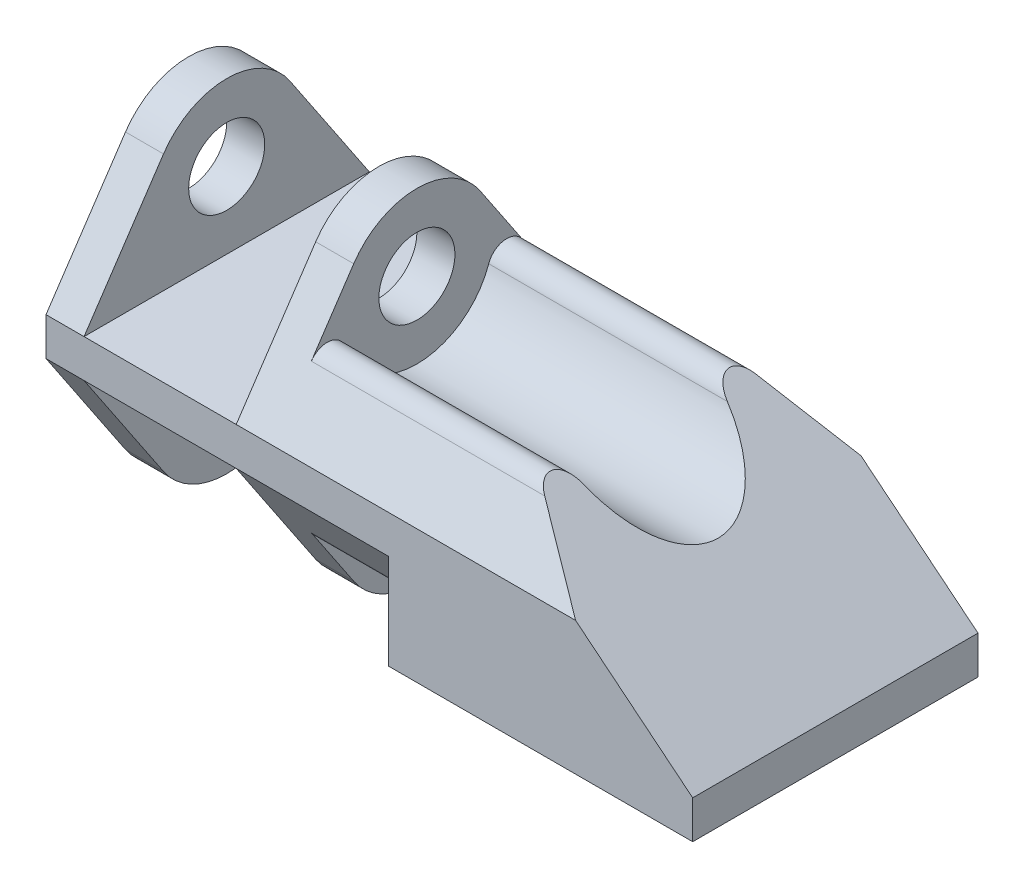
ISO-10303-21;
HEADER;
FILE_DESCRIPTION(('STEP AP214'),'2;1');
FILE_NAME('part.step','',(''),(''),'','','');
FILE_SCHEMA(('AUTOMOTIVE_DESIGN { 1 0 10303 214 1 1 1 1 }'));
ENDSEC;
DATA;
#1=APPLICATION_CONTEXT('core data for automotive mechanical design processes');
#2=APPLICATION_PROTOCOL_DEFINITION('international standard','automotive_design',2000,#1);
#3=PRODUCT_CONTEXT('',#1,'mechanical');
#4=PRODUCT('Part','Part','',(#3));
#5=PRODUCT_RELATED_PRODUCT_CATEGORY('part','',(#4));
#6=PRODUCT_DEFINITION_FORMATION('','',#4);
#7=PRODUCT_DEFINITION_CONTEXT('part definition',#1,'design');
#8=PRODUCT_DEFINITION('design','',#6,#7);
#9=PRODUCT_DEFINITION_SHAPE('','',#8);
#10=(LENGTH_UNIT() NAMED_UNIT(*) SI_UNIT(.MILLI.,.METRE.));
#11=(NAMED_UNIT(*) PLANE_ANGLE_UNIT() SI_UNIT($,.RADIAN.));
#12=(NAMED_UNIT(*) SI_UNIT($,.STERADIAN.) SOLID_ANGLE_UNIT());
#13=UNCERTAINTY_MEASURE_WITH_UNIT(LENGTH_MEASURE(1.E-05),#10,'distance_accuracy_value','');
#14=(GEOMETRIC_REPRESENTATION_CONTEXT(3) GLOBAL_UNCERTAINTY_ASSIGNED_CONTEXT((#13)) GLOBAL_UNIT_ASSIGNED_CONTEXT((#10,
#11,#12)) REPRESENTATION_CONTEXT('',''));
#15=CARTESIAN_POINT('',(0.,0.,0.));
#16=DIRECTION('',(0.,0.,1.));
#17=DIRECTION('',(1.,0.,0.));
#18=AXIS2_PLACEMENT_3D('',#15,#16,#17);
#19=CARTESIAN_POINT('',(-25.4,23.8125,11.90625));
#20=DIRECTION('',(-0.630592625094466,-0.776114000116266,0.));
#21=DIRECTION('',(0.776114000116266,-0.630592625094466,0.));
#22=AXIS2_PLACEMENT_3D('',#19,#20,#21);
#23=PLANE('',#22);
#24=DIRECTION('',(0.714789522405308,-0.580766486954313,-0.389597518331852));
#25=VECTOR('',#24,1.);
#26=CARTESIAN_POINT('',(-29.6587748598446,27.2727545736238,-1.06541255686073));
#27=LINE('',#26,#25);
#28=CARTESIAN_POINT('',(-15.4482299707213,15.7266868512111,-8.81089965397924));
#29=VERTEX_POINT('',#28);
#30=CARTESIAN_POINT('',(-9.76923076923078,11.1125,-11.90625));
#31=VERTEX_POINT('',#30);
#32=EDGE_CURVE('E168',#29,#31,#27,.T.);
#33=ORIENTED_EDGE('',*,*,#32,.F.);
#34=CARTESIAN_POINT('',(-14.359755123769,14.8423010380623,-7.49256055363323));
#35=DIRECTION('',(-0.630592625094466,-0.776114000116266,0.));
#36=DIRECTION('',(-0.776114000116266,0.630592625094466,0.));
#37=AXIS2_PLACEMENT_3D('',#34,#35,#36);
#38=ELLIPSE('',#37,2.51747314641078,1.5875);
#39=CARTESIAN_POINT('',(-15.0047271759383,15.3663408304498,-5.99404844290658));
#40=VERTEX_POINT('',#39);
#41=EDGE_CURVE('E124',#29,#40,#38,.F.);
#42=ORIENTED_EDGE('',*,*,#41,.T.);
#43=CARTESIAN_POINT('',(-17.5846153846154,17.4625,0.));
#44=DIRECTION('',(-0.630592625094466,-0.776114000116266,0.));
#45=DIRECTION('',(-0.776114000116266,0.630592625094466,0.));
#46=AXIS2_PLACEMENT_3D('',#43,#44,#45);
#47=ELLIPSE('',#46,10.0698925856431,6.35);
#48=CARTESIAN_POINT('',(-15.0047271759382,15.3663408304498,5.99404844290658));
#49=VERTEX_POINT('',#48);
#50=EDGE_CURVE('E166',#40,#49,#47,.T.);
#51=ORIENTED_EDGE('',*,*,#50,.T.);
#52=CARTESIAN_POINT('',(-14.359755123769,14.8423010380623,7.49256055363322));
#53=DIRECTION('',(-0.630592625094466,-0.776114000116266,0.));
#54=DIRECTION('',(-0.776114000116266,0.630592625094466,0.));
#55=AXIS2_PLACEMENT_3D('',#52,#53,#54);
#56=ELLIPSE('',#55,2.51747314641078,1.5875);
#57=CARTESIAN_POINT('',(-15.4482299707213,15.7266868512111,8.81089965397924));
#58=VERTEX_POINT('',#57);
#59=EDGE_CURVE('E154',#49,#58,#56,.F.);
#60=ORIENTED_EDGE('',*,*,#59,.T.);
#61=DIRECTION('',(-0.714789522405308,0.580766486954313,-0.389597518331852));
#62=VECTOR('',#61,1.);
#63=CARTESIAN_POINT('',(-23.0274645244464,21.8848149261127,4.67982207039938));
#64=LINE('',#63,#62);
#65=CARTESIAN_POINT('',(-9.76923076923077,11.1125,11.90625));
#66=VERTEX_POINT('',#65);
#67=EDGE_CURVE('E130',#66,#58,#64,.T.);
#68=ORIENTED_EDGE('',*,*,#67,.F.);
#69=DIRECTION('',(-0.776114000116265,0.630592625094466,0.));
#70=VECTOR('',#69,1.);
#71=CARTESIAN_POINT('',(-25.4,23.8125,11.90625));
#72=LINE('',#71,#70);
#73=CARTESIAN_POINT('',(0.,3.175,11.90625));
#74=VERTEX_POINT('',#73);
#75=EDGE_CURVE('E284',#74,#66,#72,.T.);
#76=ORIENTED_EDGE('',*,*,#75,.F.);
#77=DIRECTION('',(0.,0.,-1.));
#78=VECTOR('',#77,1.);
#79=CARTESIAN_POINT('',(0.,3.175,11.90625));
#80=LINE('',#79,#78);
#81=CARTESIAN_POINT('',(0.,3.175,-11.90625));
#82=VERTEX_POINT('',#81);
#83=EDGE_CURVE('E333',#74,#82,#80,.T.);
#84=ORIENTED_EDGE('',*,*,#83,.T.);
#85=DIRECTION('',(-0.776114000116265,0.630592625094466,0.));
#86=VECTOR('',#85,1.);
#87=CARTESIAN_POINT('',(-25.4,23.8125,-11.90625));
#88=LINE('',#87,#86);
#89=EDGE_CURVE('E303',#82,#31,#88,.T.);
#90=ORIENTED_EDGE('',*,*,#89,.T.);
#91=EDGE_LOOP('',(#33,#42,#51,#60,#68,#76,#84,#90));
#92=FACE_BOUND('',#91,.T.);
#93=ADVANCED_FACE('F34',(#92),#23,.F.);
#94=CARTESIAN_POINT('',(0.,0.,-11.90625));
#95=DIRECTION('',(0.,0.,-1.));
#96=DIRECTION('',(-1.,0.,0.));
#97=AXIS2_PLACEMENT_3D('',#94,#95,#96);
#98=PLANE('',#97);
#99=DIRECTION('',(-1.,0.,0.));
#100=VECTOR('',#99,1.);
#101=CARTESIAN_POINT('',(-7.99170344167758,11.1125,-11.90625));
#102=LINE('',#101,#100);
#103=CARTESIAN_POINT('',(-38.1,11.1125,-11.90625));
#104=VERTEX_POINT('',#103);
#105=EDGE_CURVE('E235',#31,#104,#102,.T.);
#106=ORIENTED_EDGE('',*,*,#105,.F.);
#107=ORIENTED_EDGE('',*,*,#89,.F.);
#108=DIRECTION('',(0.,1.,0.));
#109=VECTOR('',#108,1.);
#110=CARTESIAN_POINT('',(0.,3.175,-11.90625));
#111=LINE('',#110,#109);
#112=CARTESIAN_POINT('',(0.,0.,-11.90625));
#113=VERTEX_POINT('',#112);
#114=EDGE_CURVE('E280',#113,#82,#111,.T.);
#115=ORIENTED_EDGE('',*,*,#114,.F.);
#116=DIRECTION('',(1.,0.,0.));
#117=VECTOR('',#116,1.);
#118=CARTESIAN_POINT('',(0.,0.,-11.90625));
#119=LINE('',#118,#117);
#120=CARTESIAN_POINT('',(-25.4,0.,-11.90625));
#121=VERTEX_POINT('',#120);
#122=EDGE_CURVE('E285',#121,#113,#119,.T.);
#123=ORIENTED_EDGE('',*,*,#122,.F.);
#124=DIRECTION('',(0.,1.,0.));
#125=VECTOR('',#124,1.);
#126=CARTESIAN_POINT('',(-25.4,0.,-11.90625));
#127=LINE('',#126,#125);
#128=CARTESIAN_POINT('',(-25.4,7.9375,-11.90625));
#129=VERTEX_POINT('',#128);
#130=EDGE_CURVE('E194',#121,#129,#127,.T.);
#131=ORIENTED_EDGE('',*,*,#130,.T.);
#132=DIRECTION('',(-1.,0.,0.));
#133=VECTOR('',#132,1.);
#134=CARTESIAN_POINT('',(-7.99170344167758,7.9375,-11.90625));
#135=LINE('',#134,#133);
#136=CARTESIAN_POINT('',(-38.1,7.9375,-11.90625));
#137=VERTEX_POINT('',#136);
#138=EDGE_CURVE('E207',#129,#137,#135,.T.);
#139=ORIENTED_EDGE('',*,*,#138,.T.);
#140=DIRECTION('',(1.,0.,0.));
#141=VECTOR('',#140,1.);
#142=CARTESIAN_POINT('',(-38.1,7.9375,-11.90625));
#143=LINE('',#142,#141);
#144=CARTESIAN_POINT('',(-50.8,7.9375,-11.90625));
#145=VERTEX_POINT('',#144);
#146=EDGE_CURVE('E311',#145,#137,#143,.T.);
#147=ORIENTED_EDGE('',*,*,#146,.F.);
#148=CARTESIAN_POINT('',(-53.975,7.9375,-11.90625));
#149=VERTEX_POINT('',#148);
#150=EDGE_CURVE('E210',#145,#149,#135,.T.);
#151=ORIENTED_EDGE('',*,*,#150,.T.);
#152=DIRECTION('',(0.,-1.,0.));
#153=VECTOR('',#152,1.);
#154=CARTESIAN_POINT('',(-53.975,-4.7625,-11.90625));
#155=LINE('',#154,#153);
#156=CARTESIAN_POINT('',(-53.975,11.1125,-11.90625));
#157=VERTEX_POINT('',#156);
#158=EDGE_CURVE('E308',#157,#149,#155,.T.);
#159=ORIENTED_EDGE('',*,*,#158,.F.);
#160=DIRECTION('',(1.,0.,0.));
#161=VECTOR('',#160,1.);
#162=CARTESIAN_POINT('',(0.,11.1125,-11.90625));
#163=LINE('',#162,#161);
#164=CARTESIAN_POINT('',(-50.8,11.1125,-11.90625));
#165=VERTEX_POINT('',#164);
#166=EDGE_CURVE('E336',#157,#165,#163,.T.);
#167=ORIENTED_EDGE('',*,*,#166,.T.);
#168=DIRECTION('',(-1.,0.,0.));
#169=VECTOR('',#168,1.);
#170=CARTESIAN_POINT('',(-50.8,11.1125,-11.90625));
#171=LINE('',#170,#169);
#172=EDGE_CURVE('E305',#104,#165,#171,.T.);
#173=ORIENTED_EDGE('',*,*,#172,.F.);
#174=EDGE_LOOP('',(#106,#107,#115,#123,#131,#139,#147,#151,#159,#167,#173));
#175=FACE_BOUND('',#174,.T.);
#176=ADVANCED_FACE('F501',(#175),#98,.T.);
#177=CARTESIAN_POINT('',(0.,0.,11.90625));
#178=DIRECTION('',(0.,0.,-1.));
#179=DIRECTION('',(-1.,0.,0.));
#180=AXIS2_PLACEMENT_3D('',#177,#178,#179);
#181=PLANE('',#180);
#182=ORIENTED_EDGE('',*,*,#75,.T.);
#183=DIRECTION('',(-1.,0.,0.));
#184=VECTOR('',#183,1.);
#185=CARTESIAN_POINT('',(-7.99170344167758,11.1125,11.90625));
#186=LINE('',#185,#184);
#187=CARTESIAN_POINT('',(-38.1,11.1125,11.90625));
#188=VERTEX_POINT('',#187);
#189=EDGE_CURVE('E195',#66,#188,#186,.T.);
#190=ORIENTED_EDGE('',*,*,#189,.T.);
#191=DIRECTION('',(-1.,0.,0.));
#192=VECTOR('',#191,1.);
#193=CARTESIAN_POINT('',(-50.8,11.1125,11.90625));
#194=LINE('',#193,#192);
#195=CARTESIAN_POINT('',(-50.8,11.1125,11.90625));
#196=VERTEX_POINT('',#195);
#197=EDGE_CURVE('E288',#188,#196,#194,.T.);
#198=ORIENTED_EDGE('',*,*,#197,.T.);
#199=DIRECTION('',(1.,0.,0.));
#200=VECTOR('',#199,1.);
#201=CARTESIAN_POINT('',(0.,11.1125,11.90625));
#202=LINE('',#201,#200);
#203=CARTESIAN_POINT('',(-53.975,11.1125,11.90625));
#204=VERTEX_POINT('',#203);
#205=EDGE_CURVE('E342',#204,#196,#202,.T.);
#206=ORIENTED_EDGE('',*,*,#205,.F.);
#207=DIRECTION('',(0.,-1.,0.));
#208=VECTOR('',#207,1.);
#209=CARTESIAN_POINT('',(-53.975,-4.7625,11.90625));
#210=LINE('',#209,#208);
#211=CARTESIAN_POINT('',(-53.975,7.9375,11.90625));
#212=VERTEX_POINT('',#211);
#213=EDGE_CURVE('E291',#204,#212,#210,.T.);
#214=ORIENTED_EDGE('',*,*,#213,.T.);
#215=DIRECTION('',(1.,0.,0.));
#216=VECTOR('',#215,1.);
#217=CARTESIAN_POINT('',(0.,7.9375,11.90625));
#218=LINE('',#217,#216);
#219=CARTESIAN_POINT('',(-50.8,7.9375,11.90625));
#220=VERTEX_POINT('',#219);
#221=EDGE_CURVE('E339',#212,#220,#218,.T.);
#222=ORIENTED_EDGE('',*,*,#221,.T.);
#223=DIRECTION('',(1.,0.,0.));
#224=VECTOR('',#223,1.);
#225=CARTESIAN_POINT('',(-38.1,7.9375,11.90625));
#226=LINE('',#225,#224);
#227=CARTESIAN_POINT('',(-38.1,7.9375,11.90625));
#228=VERTEX_POINT('',#227);
#229=EDGE_CURVE('E294',#220,#228,#226,.T.);
#230=ORIENTED_EDGE('',*,*,#229,.T.);
#231=DIRECTION('',(-1.,0.,0.));
#232=VECTOR('',#231,1.);
#233=CARTESIAN_POINT('',(-7.99170344167758,7.9375,11.90625));
#234=LINE('',#233,#232);
#235=CARTESIAN_POINT('',(-25.4,7.9375,11.90625));
#236=VERTEX_POINT('',#235);
#237=EDGE_CURVE('E252',#236,#228,#234,.T.);
#238=ORIENTED_EDGE('',*,*,#237,.F.);
#239=DIRECTION('',(0.,-1.,0.));
#240=VECTOR('',#239,1.);
#241=CARTESIAN_POINT('',(-25.4,0.,11.90625));
#242=LINE('',#241,#240);
#243=CARTESIAN_POINT('',(-25.4,0.,11.90625));
#244=VERTEX_POINT('',#243);
#245=EDGE_CURVE('E241',#236,#244,#242,.T.);
#246=ORIENTED_EDGE('',*,*,#245,.T.);
#247=DIRECTION('',(1.,0.,0.));
#248=VECTOR('',#247,1.);
#249=CARTESIAN_POINT('',(0.,0.,11.90625));
#250=LINE('',#249,#248);
#251=CARTESIAN_POINT('',(0.,0.,11.90625));
#252=VERTEX_POINT('',#251);
#253=EDGE_CURVE('E297',#244,#252,#250,.T.);
#254=ORIENTED_EDGE('',*,*,#253,.T.);
#255=DIRECTION('',(0.,1.,0.));
#256=VECTOR('',#255,1.);
#257=CARTESIAN_POINT('',(0.,3.175,11.90625));
#258=LINE('',#257,#256);
#259=EDGE_CURVE('E281',#252,#74,#258,.T.);
#260=ORIENTED_EDGE('',*,*,#259,.T.);
#261=EDGE_LOOP('',(#182,#190,#198,#206,#214,#222,#230,#238,#246,#254,#260));
#262=FACE_BOUND('',#261,.T.);
#263=ADVANCED_FACE('F513',(#262),#181,.F.);
#264=CARTESIAN_POINT('',(-38.1,11.1125,11.90625));
#265=DIRECTION('',(1.,0.,0.));
#266=DIRECTION('',(0.,1.,0.));
#267=AXIS2_PLACEMENT_3D('',#264,#265,#266);
#268=PLANE('',#267);
#269=CARTESIAN_POINT('',(-38.1,17.4625,0.));
#270=DIRECTION('',(1.,0.,0.));
#271=DIRECTION('',(0.,1.,0.));
#272=AXIS2_PLACEMENT_3D('',#269,#270,#271);
#273=CIRCLE('',#272,3.175);
#274=CARTESIAN_POINT('',(-38.1,20.6375,0.));
#275=VERTEX_POINT('',#274);
#276=EDGE_CURVE('E184',#275,#275,#273,.T.);
#277=ORIENTED_EDGE('',*,*,#276,.T.);
#278=EDGE_LOOP('',(#277));
#279=FACE_BOUND('',#278,.T.);
#280=DIRECTION('',(0.,-0.830449826989619,0.557093425605537));
#281=VECTOR('',#280,1.);
#282=CARTESIAN_POINT('',(-38.1,11.1125,11.90625));
#283=LINE('',#282,#281);
#284=CARTESIAN_POINT('',(-38.1,21.0000432525952,5.27335640138408));
#285=VERTEX_POINT('',#284);
#286=EDGE_CURVE('E218',#285,#188,#283,.T.);
#287=ORIENTED_EDGE('',*,*,#286,.F.);
#288=CARTESIAN_POINT('',(-38.1,17.4625,0.));
#289=DIRECTION('',(1.,0.,0.));
#290=DIRECTION('',(0.,1.,0.));
#291=AXIS2_PLACEMENT_3D('',#288,#289,#290);
#292=CIRCLE('',#291,6.35);
#293=CARTESIAN_POINT('',(-38.1,21.0000432525952,-5.27335640138409));
#294=VERTEX_POINT('',#293);
#295=EDGE_CURVE('E277',#294,#285,#292,.T.);
#296=ORIENTED_EDGE('',*,*,#295,.F.);
#297=DIRECTION('',(0.,0.830449826989619,0.557093425605536));
#298=VECTOR('',#297,1.);
#299=CARTESIAN_POINT('',(-38.1,22.1290706828223,-4.51596716694005));
#300=LINE('',#299,#298);
#301=EDGE_CURVE('E260',#104,#294,#300,.T.);
#302=ORIENTED_EDGE('',*,*,#301,.F.);
#303=DIRECTION('',(0.,0.,-1.));
#304=VECTOR('',#303,1.);
#305=CARTESIAN_POINT('',(-38.1,11.1125,11.90625));
#306=LINE('',#305,#304);
#307=EDGE_CURVE('E330',#188,#104,#306,.T.);
#308=ORIENTED_EDGE('',*,*,#307,.F.);
#309=EDGE_LOOP('',(#287,#296,#302,#308));
#310=FACE_BOUND('',#309,.T.);
#311=ADVANCED_FACE('F558',(#279,#310),#268,.F.);
#312=CARTESIAN_POINT('',(-50.8,23.8125,11.90625));
#313=DIRECTION('',(-1.,0.,0.));
#314=DIRECTION('',(0.,-1.,0.));
#315=AXIS2_PLACEMENT_3D('',#312,#313,#314);
#316=PLANE('',#315);
#317=CARTESIAN_POINT('',(-50.8,17.4625,0.));
#318=DIRECTION('',(-1.,0.,0.));
#319=DIRECTION('',(0.,-1.,0.));
#320=AXIS2_PLACEMENT_3D('',#317,#318,#319);
#321=CIRCLE('',#320,3.175);
#322=CARTESIAN_POINT('',(-50.8,14.2875,0.));
#323=VERTEX_POINT('',#322);
#324=EDGE_CURVE('E175',#323,#323,#321,.T.);
#325=ORIENTED_EDGE('',*,*,#324,.T.);
#326=EDGE_LOOP('',(#325));
#327=FACE_BOUND('',#326,.T.);
#328=DIRECTION('',(0.,0.830449826989619,-0.557093425605537));
#329=VECTOR('',#328,1.);
#330=CARTESIAN_POINT('',(-50.8,19.871015822368,6.03074563582811));
#331=LINE('',#330,#329);
#332=CARTESIAN_POINT('',(-50.8,21.0000432525952,5.27335640138408));
#333=VERTEX_POINT('',#332);
#334=EDGE_CURVE('E198',#196,#333,#331,.T.);
#335=ORIENTED_EDGE('',*,*,#334,.F.);
#336=DIRECTION('',(0.,0.,-1.));
#337=VECTOR('',#336,1.);
#338=CARTESIAN_POINT('',(-50.8,11.1125,11.90625));
#339=LINE('',#338,#337);
#340=EDGE_CURVE('E327',#196,#165,#339,.T.);
#341=ORIENTED_EDGE('',*,*,#340,.T.);
#342=DIRECTION('',(0.,-0.830449826989619,-0.557093425605536));
#343=VECTOR('',#342,1.);
#344=CARTESIAN_POINT('',(-50.8,30.8875865051903,1.35953719723183));
#345=LINE('',#344,#343);
#346=CARTESIAN_POINT('',(-50.8,21.0000432525952,-5.27335640138409));
#347=VERTEX_POINT('',#346);
#348=EDGE_CURVE('E237',#347,#165,#345,.T.);
#349=ORIENTED_EDGE('',*,*,#348,.F.);
#350=CARTESIAN_POINT('',(-50.8,17.4625,0.));
#351=DIRECTION('',(-1.,0.,0.));
#352=DIRECTION('',(0.,-1.,0.));
#353=AXIS2_PLACEMENT_3D('',#350,#351,#352);
#354=CIRCLE('',#353,6.35);
#355=EDGE_CURVE('E274',#333,#347,#354,.T.);
#356=ORIENTED_EDGE('',*,*,#355,.F.);
#357=EDGE_LOOP('',(#335,#341,#349,#356));
#358=FACE_BOUND('',#357,.T.);
#359=ADVANCED_FACE('F552',(#327,#358),#316,.F.);
#360=CARTESIAN_POINT('',(-53.975,-4.7625,11.90625));
#361=DIRECTION('',(1.,0.,0.));
#362=DIRECTION('',(0.,0.,-1.));
#363=AXIS2_PLACEMENT_3D('',#360,#361,#362);
#364=PLANE('',#363);
#365=CARTESIAN_POINT('',(-53.975,1.5875,0.));
#366=DIRECTION('',(-1.,0.,0.));
#367=DIRECTION('',(0.,0.,1.));
#368=AXIS2_PLACEMENT_3D('',#365,#366,#367);
#369=CIRCLE('',#368,3.175);
#370=CARTESIAN_POINT('',(-53.975,1.5875,3.175));
#371=VERTEX_POINT('',#370);
#372=EDGE_CURVE('E349',#371,#371,#369,.T.);
#373=ORIENTED_EDGE('',*,*,#372,.F.);
#374=EDGE_LOOP('',(#373));
#375=FACE_BOUND('',#374,.T.);
#376=CARTESIAN_POINT('',(-53.975,17.4625,0.));
#377=DIRECTION('',(-1.,0.,0.));
#378=DIRECTION('',(0.,0.,1.));
#379=AXIS2_PLACEMENT_3D('',#376,#377,#378);
#380=CIRCLE('',#379,3.175);
#381=CARTESIAN_POINT('',(-53.975,17.4625,3.175));
#382=VERTEX_POINT('',#381);
#383=EDGE_CURVE('E171',#382,#382,#380,.T.);
#384=ORIENTED_EDGE('',*,*,#383,.F.);
#385=EDGE_LOOP('',(#384));
#386=FACE_BOUND('',#385,.T.);
#387=DIRECTION('',(0.,0.830449826989619,-0.557093425605537));
#388=VECTOR('',#387,1.);
#389=CARTESIAN_POINT('',(-53.975,8.95708399683913,13.3521749021204));
#390=LINE('',#389,#388);
#391=CARTESIAN_POINT('',(-53.975,21.0000432525952,5.27335640138408));
#392=VERTEX_POINT('',#391);
#393=EDGE_CURVE('E190',#204,#392,#390,.T.);
#394=ORIENTED_EDGE('',*,*,#393,.T.);
#395=CARTESIAN_POINT('',(-53.975,17.4625,0.));
#396=DIRECTION('',(-1.,0.,0.));
#397=DIRECTION('',(0.,0.,1.));
#398=AXIS2_PLACEMENT_3D('',#395,#396,#397);
#399=CIRCLE('',#398,6.35);
#400=CARTESIAN_POINT('',(-53.975,21.0000432525952,-5.27335640138409));
#401=VERTEX_POINT('',#400);
#402=EDGE_CURVE('E228',#392,#401,#399,.T.);
#403=ORIENTED_EDGE('',*,*,#402,.T.);
#404=DIRECTION('',(0.,-0.830449826989619,-0.557093425605537));
#405=VECTOR('',#404,1.);
#406=CARTESIAN_POINT('',(-53.975,8.95708399683912,-13.3521749021204));
#407=LINE('',#406,#405);
#408=EDGE_CURVE('E231',#401,#157,#407,.T.);
#409=ORIENTED_EDGE('',*,*,#408,.T.);
#410=ORIENTED_EDGE('',*,*,#158,.T.);
#411=DIRECTION('',(0.,-0.830449826989619,0.557093425605536));
#412=VECTOR('',#411,1.);
#413=CARTESIAN_POINT('',(-53.975,-3.04485773039116,-4.5389183558626));
#414=LINE('',#413,#412);
#415=CARTESIAN_POINT('',(-53.975,-1.95004325259516,-5.27335640138408));
#416=VERTEX_POINT('',#415);
#417=EDGE_CURVE('E189',#149,#416,#414,.T.);
#418=ORIENTED_EDGE('',*,*,#417,.T.);
#419=CARTESIAN_POINT('',(-53.975,1.5875,0.));
#420=DIRECTION('',(-1.,0.,0.));
#421=DIRECTION('',(0.,0.,1.));
#422=AXIS2_PLACEMENT_3D('',#419,#420,#421);
#423=CIRCLE('',#422,6.35);
#424=CARTESIAN_POINT('',(-53.975,-1.95004325259515,5.27335640138408));
#425=VERTEX_POINT('',#424);
#426=EDGE_CURVE('E227',#416,#425,#423,.T.);
#427=ORIENTED_EDGE('',*,*,#426,.T.);
#428=DIRECTION('',(0.,-0.830449826989619,-0.557093425605537));
#429=VECTOR('',#428,1.);
#430=CARTESIAN_POINT('',(-53.975,-3.04485773039116,4.53891835586259));
#431=LINE('',#430,#429);
#432=EDGE_CURVE('E249',#212,#425,#431,.T.);
#433=ORIENTED_EDGE('',*,*,#432,.F.);
#434=ORIENTED_EDGE('',*,*,#213,.F.);
#435=EDGE_LOOP('',(#394,#403,#409,#410,#418,#427,#433,#434));
#436=FACE_BOUND('',#435,.T.);
#437=ADVANCED_FACE('F539',(#375,#386,#436),#364,.F.);
#438=CARTESIAN_POINT('',(-50.8,7.9375,11.90625));
#439=DIRECTION('',(-1.,0.,0.));
#440=DIRECTION('',(0.,-1.,0.));
#441=AXIS2_PLACEMENT_3D('',#438,#439,#440);
#442=PLANE('',#441);
#443=CARTESIAN_POINT('',(-50.8,1.5875,0.));
#444=DIRECTION('',(-1.,0.,0.));
#445=DIRECTION('',(0.,-1.,0.));
#446=AXIS2_PLACEMENT_3D('',#443,#444,#445);
#447=CIRCLE('',#446,3.175);
#448=CARTESIAN_POINT('',(-50.8,-1.5875,0.));
#449=VERTEX_POINT('',#448);
#450=EDGE_CURVE('E392',#449,#449,#447,.T.);
#451=ORIENTED_EDGE('',*,*,#450,.T.);
#452=EDGE_LOOP('',(#451));
#453=FACE_BOUND('',#452,.T.);
#454=DIRECTION('',(0.,-0.83044982698962,0.557093425605536));
#455=VECTOR('',#454,1.);
#456=CARTESIAN_POINT('',(-50.8,-3.07907068282228,-4.51596716694005));
#457=LINE('',#456,#455);
#458=CARTESIAN_POINT('',(-50.8,-1.95004325259516,-5.27335640138408));
#459=VERTEX_POINT('',#458);
#460=EDGE_CURVE('E224',#145,#459,#457,.T.);
#461=ORIENTED_EDGE('',*,*,#460,.F.);
#462=DIRECTION('',(0.,0.,-1.));
#463=VECTOR('',#462,1.);
#464=CARTESIAN_POINT('',(-50.8,7.9375,11.90625));
#465=LINE('',#464,#463);
#466=EDGE_CURVE('E324',#220,#145,#465,.T.);
#467=ORIENTED_EDGE('',*,*,#466,.F.);
#468=DIRECTION('',(0.,-0.830449826989619,-0.557093425605537));
#469=VECTOR('',#468,1.);
#470=CARTESIAN_POINT('',(-50.8,7.9375,11.90625));
#471=LINE('',#470,#469);
#472=CARTESIAN_POINT('',(-50.8,-1.95004325259515,5.27335640138408));
#473=VERTEX_POINT('',#472);
#474=EDGE_CURVE('E265',#220,#473,#471,.T.);
#475=ORIENTED_EDGE('',*,*,#474,.T.);
#476=CARTESIAN_POINT('',(-50.8,1.5875,0.));
#477=DIRECTION('',(-1.,0.,0.));
#478=DIRECTION('',(0.,-1.,0.));
#479=AXIS2_PLACEMENT_3D('',#476,#477,#478);
#480=CIRCLE('',#479,6.35);
#481=EDGE_CURVE('E271',#459,#473,#480,.T.);
#482=ORIENTED_EDGE('',*,*,#481,.F.);
#483=EDGE_LOOP('',(#461,#467,#475,#482));
#484=FACE_BOUND('',#483,.T.);
#485=ADVANCED_FACE('F529',(#453,#484),#442,.F.);
#486=CARTESIAN_POINT('',(-38.1,-4.7625,11.90625));
#487=DIRECTION('',(1.,0.,0.));
#488=DIRECTION('',(0.,0.,-1.));
#489=AXIS2_PLACEMENT_3D('',#486,#487,#488);
#490=PLANE('',#489);
#491=CARTESIAN_POINT('',(-38.1,1.5875,0.));
#492=DIRECTION('',(1.,0.,0.));
#493=DIRECTION('',(0.,0.,-1.));
#494=AXIS2_PLACEMENT_3D('',#491,#492,#493);
#495=CIRCLE('',#494,3.175);
#496=CARTESIAN_POINT('',(-38.1,1.5875,-3.175));
#497=VERTEX_POINT('',#496);
#498=EDGE_CURVE('E390',#497,#497,#495,.T.);
#499=ORIENTED_EDGE('',*,*,#498,.T.);
#500=EDGE_LOOP('',(#499));
#501=FACE_BOUND('',#500,.T.);
#502=DIRECTION('',(0.,0.83044982698962,-0.557093425605536));
#503=VECTOR('',#502,1.);
#504=CARTESIAN_POINT('',(-38.1,-11.8375865051903,1.35953719723183));
#505=LINE('',#504,#503);
#506=CARTESIAN_POINT('',(-38.1,-1.95004325259516,-5.27335640138408));
#507=VERTEX_POINT('',#506);
#508=EDGE_CURVE('E221',#507,#137,#505,.T.);
#509=ORIENTED_EDGE('',*,*,#508,.F.);
#510=CARTESIAN_POINT('',(-38.1,1.5875,0.));
#511=DIRECTION('',(1.,0.,0.));
#512=DIRECTION('',(0.,0.,-1.));
#513=AXIS2_PLACEMENT_3D('',#510,#511,#512);
#514=CIRCLE('',#513,6.35);
#515=CARTESIAN_POINT('',(-38.1,-1.95004325259515,5.27335640138408));
#516=VERTEX_POINT('',#515);
#517=EDGE_CURVE('E268',#516,#507,#514,.T.);
#518=ORIENTED_EDGE('',*,*,#517,.F.);
#519=DIRECTION('',(0.,0.830449826989619,0.557093425605537));
#520=VECTOR('',#519,1.);
#521=CARTESIAN_POINT('',(-38.1,-0.821015822368021,6.03074563582811));
#522=LINE('',#521,#520);
#523=EDGE_CURVE('E262',#516,#228,#522,.T.);
#524=ORIENTED_EDGE('',*,*,#523,.T.);
#525=DIRECTION('',(0.,0.,-1.));
#526=VECTOR('',#525,1.);
#527=CARTESIAN_POINT('',(-38.1,7.9375,11.90625));
#528=LINE('',#527,#526);
#529=EDGE_CURVE('E321',#228,#137,#528,.T.);
#530=ORIENTED_EDGE('',*,*,#529,.T.);
#531=EDGE_LOOP('',(#509,#518,#524,#530));
#532=FACE_BOUND('',#531,.T.);
#533=ADVANCED_FACE('F519',(#501,#532),#490,.F.);
#534=CARTESIAN_POINT('',(0.,3.175,11.90625));
#535=DIRECTION('',(-1.,0.,0.));
#536=DIRECTION('',(0.,0.,1.));
#537=AXIS2_PLACEMENT_3D('',#534,#535,#536);
#538=PLANE('',#537);
#539=ORIENTED_EDGE('',*,*,#114,.T.);
#540=ORIENTED_EDGE('',*,*,#83,.F.);
#541=ORIENTED_EDGE('',*,*,#259,.F.);
#542=DIRECTION('',(0.,0.,-1.));
#543=VECTOR('',#542,1.);
#544=CARTESIAN_POINT('',(0.,0.,11.90625));
#545=LINE('',#544,#543);
#546=EDGE_CURVE('E300',#252,#113,#545,.T.);
#547=ORIENTED_EDGE('',*,*,#546,.T.);
#548=EDGE_LOOP('',(#539,#540,#541,#547));
#549=FACE_BOUND('',#548,.T.);
#550=ADVANCED_FACE('F506',(#549),#538,.F.);
#551=CARTESIAN_POINT('',(-50.8,11.1125,11.90625));
#552=DIRECTION('',(0.,-1.,0.));
#553=DIRECTION('',(0.,0.,-1.));
#554=AXIS2_PLACEMENT_3D('',#551,#552,#553);
#555=PLANE('',#554);
#556=ORIENTED_EDGE('',*,*,#172,.T.);
#557=ORIENTED_EDGE('',*,*,#340,.F.);
#558=ORIENTED_EDGE('',*,*,#197,.F.);
#559=ORIENTED_EDGE('',*,*,#307,.T.);
#560=EDGE_LOOP('',(#556,#557,#558,#559));
#561=FACE_BOUND('',#560,.T.);
#562=ADVANCED_FACE('F546',(#561),#555,.F.);
#563=CARTESIAN_POINT('',(-38.1,7.9375,11.90625));
#564=DIRECTION('',(0.,1.,0.));
#565=DIRECTION('',(0.,0.,1.));
#566=AXIS2_PLACEMENT_3D('',#563,#564,#565);
#567=PLANE('',#566);
#568=ORIENTED_EDGE('',*,*,#146,.T.);
#569=ORIENTED_EDGE('',*,*,#529,.F.);
#570=ORIENTED_EDGE('',*,*,#229,.F.);
#571=ORIENTED_EDGE('',*,*,#466,.T.);
#572=EDGE_LOOP('',(#568,#569,#570,#571));
#573=FACE_BOUND('',#572,.T.);
#574=ADVANCED_FACE('F525',(#573),#567,.F.);
#575=CARTESIAN_POINT('',(0.,0.,11.90625));
#576=DIRECTION('',(0.,1.,0.));
#577=DIRECTION('',(-1.,0.,0.));
#578=AXIS2_PLACEMENT_3D('',#575,#576,#577);
#579=PLANE('',#578);
#580=ORIENTED_EDGE('',*,*,#122,.T.);
#581=ORIENTED_EDGE('',*,*,#546,.F.);
#582=ORIENTED_EDGE('',*,*,#253,.F.);
#583=DIRECTION('',(0.,0.,-1.));
#584=VECTOR('',#583,1.);
#585=CARTESIAN_POINT('',(-25.4,0.,11.90625));
#586=LINE('',#585,#584);
#587=EDGE_CURVE('E318',#244,#121,#586,.T.);
#588=ORIENTED_EDGE('',*,*,#587,.T.);
#589=EDGE_LOOP('',(#580,#581,#582,#588));
#590=FACE_BOUND('',#589,.T.);
#591=ADVANCED_FACE('F509',(#590),#579,.F.);
#592=CARTESIAN_POINT('',(-7.99170344167758,8.95708399683912,-13.3521749021204));
#593=DIRECTION('',(0.,0.557093425605536,-0.830449826989619));
#594=DIRECTION('',(0.,0.830449826989619,0.557093425605536));
#595=AXIS2_PLACEMENT_3D('',#592,#593,#594);
#596=PLANE('',#595);
#597=DIRECTION('',(-1.,0.,0.));
#598=VECTOR('',#597,1.);
#599=CARTESIAN_POINT('',(-7.99170344167758,21.0000432525952,-5.27335640138409));
#600=LINE('',#599,#598);
#601=CARTESIAN_POINT('',(-34.925,21.0000432525952,-5.27335640138408));
#602=VERTEX_POINT('',#601);
#603=EDGE_CURVE('E153',#602,#294,#600,.T.);
#604=ORIENTED_EDGE('',*,*,#603,.F.);
#605=DIRECTION('',(0.,-0.830449826989619,-0.557093425605536));
#606=VECTOR('',#605,1.);
#607=CARTESIAN_POINT('',(-34.925,21.0000432525952,-5.27335640138409));
#608=LINE('',#607,#606);
#609=CARTESIAN_POINT('',(-34.925,15.7266868512111,-8.81089965397924));
#610=VERTEX_POINT('',#609);
#611=EDGE_CURVE('E51',#602,#610,#608,.T.);
#612=ORIENTED_EDGE('',*,*,#611,.T.);
#613=DIRECTION('',(1.,0.,0.));
#614=VECTOR('',#613,1.);
#615=CARTESIAN_POINT('',(-21.9385147724248,15.7266868512111,-8.81089965397924));
#616=LINE('',#615,#614);
#617=EDGE_CURVE('E149',#610,#29,#616,.T.);
#618=ORIENTED_EDGE('',*,*,#617,.T.);
#619=ORIENTED_EDGE('',*,*,#32,.T.);
#620=ORIENTED_EDGE('',*,*,#105,.T.);
#621=ORIENTED_EDGE('',*,*,#301,.T.);
#622=EDGE_LOOP('',(#604,#612,#618,#619,#620,#621));
#623=FACE_BOUND('',#622,.T.);
#624=ADVANCED_FACE('F147',(#623),#596,.T.);
#625=CARTESIAN_POINT('',(-7.99170344167758,17.4625,0.));
#626=DIRECTION('',(-1.,0.,0.));
#627=DIRECTION('',(0.,0.,1.));
#628=AXIS2_PLACEMENT_3D('',#625,#626,#627);
#629=CYLINDRICAL_SURFACE('',#628,6.35);
#630=CARTESIAN_POINT('',(-34.925,17.4625,0.));
#631=DIRECTION('',(-1.,0.,0.));
#632=DIRECTION('',(0.,-1.,0.));
#633=AXIS2_PLACEMENT_3D('',#630,#631,#632);
#634=CIRCLE('',#633,6.35);
#635=CARTESIAN_POINT('',(-34.925,21.0000432525952,5.27335640138408));
#636=VERTEX_POINT('',#635);
#637=EDGE_CURVE('E120',#636,#602,#634,.T.);
#638=ORIENTED_EDGE('',*,*,#637,.T.);
#639=ORIENTED_EDGE('',*,*,#603,.T.);
#640=ORIENTED_EDGE('',*,*,#295,.T.);
#641=DIRECTION('',(-1.,0.,0.));
#642=VECTOR('',#641,1.);
#643=CARTESIAN_POINT('',(-7.99170344167758,21.0000432525952,5.27335640138408));
#644=LINE('',#643,#642);
#645=EDGE_CURVE('E199',#636,#285,#644,.T.);
#646=ORIENTED_EDGE('',*,*,#645,.F.);
#647=EDGE_LOOP('',(#638,#639,#640,#646));
#648=FACE_BOUND('',#647,.T.);
#649=ADVANCED_FACE('F397',(#648),#629,.T.);
#650=ORIENTED_EDGE('',*,*,#355,.T.);
#651=EDGE_CURVE('E238',#347,#401,#600,.T.);
#652=ORIENTED_EDGE('',*,*,#651,.T.);
#653=ORIENTED_EDGE('',*,*,#402,.F.);
#654=EDGE_CURVE('E193',#333,#392,#644,.T.);
#655=ORIENTED_EDGE('',*,*,#654,.F.);
#656=EDGE_LOOP('',(#650,#652,#653,#655));
#657=FACE_BOUND('',#656,.T.);
#658=ADVANCED_FACE('F784',(#657),#629,.T.);
#659=ORIENTED_EDGE('',*,*,#348,.T.);
#660=ORIENTED_EDGE('',*,*,#166,.F.);
#661=ORIENTED_EDGE('',*,*,#408,.F.);
#662=ORIENTED_EDGE('',*,*,#651,.F.);
#663=EDGE_LOOP('',(#659,#660,#661,#662));
#664=FACE_BOUND('',#663,.T.);
#665=ADVANCED_FACE('F693',(#664),#596,.T.);
#666=CARTESIAN_POINT('',(-25.4,0.,11.90625));
#667=DIRECTION('',(-1.,0.,0.));
#668=DIRECTION('',(0.,0.,1.));
#669=AXIS2_PLACEMENT_3D('',#666,#667,#668);
#670=PLANE('',#669);
#671=ORIENTED_EDGE('',*,*,#587,.F.);
#672=ORIENTED_EDGE('',*,*,#245,.F.);
#673=DIRECTION('',(0.,0.830449826989619,0.557093425605537));
#674=VECTOR('',#673,1.);
#675=CARTESIAN_POINT('',(-25.4,-3.04485773039116,4.53891835586259));
#676=LINE('',#675,#674);
#677=CARTESIAN_POINT('',(-25.4,3.32331314878894,8.81089965397924));
#678=VERTEX_POINT('',#677);
#679=EDGE_CURVE('E232',#678,#236,#676,.T.);
#680=ORIENTED_EDGE('',*,*,#679,.F.);
#681=CARTESIAN_POINT('',(-25.4,4.20769896193773,7.49256055363322));
#682=DIRECTION('',(-1.,0.,0.));
#683=DIRECTION('',(0.,0.,1.));
#684=AXIS2_PLACEMENT_3D('',#681,#682,#683);
#685=CIRCLE('',#684,1.5875);
#686=CARTESIAN_POINT('',(-25.4,3.68365916955018,5.99404844290658));
#687=VERTEX_POINT('',#686);
#688=EDGE_CURVE('E140',#678,#687,#685,.F.);
#689=ORIENTED_EDGE('',*,*,#688,.T.);
#690=CARTESIAN_POINT('',(-25.4,1.5875,0.));
#691=DIRECTION('',(-1.,0.,0.));
#692=DIRECTION('',(0.,0.,1.));
#693=AXIS2_PLACEMENT_3D('',#690,#691,#692);
#694=CIRCLE('',#693,6.35);
#695=CARTESIAN_POINT('',(-25.4,3.68365916955018,-5.99404844290658));
#696=VERTEX_POINT('',#695);
#697=EDGE_CURVE('E350',#696,#687,#694,.F.);
#698=ORIENTED_EDGE('',*,*,#697,.F.);
#699=CARTESIAN_POINT('',(-25.4,4.20769896193772,-7.49256055363322));
#700=DIRECTION('',(-1.,0.,0.));
#701=DIRECTION('',(0.,0.,1.));
#702=AXIS2_PLACEMENT_3D('',#699,#700,#701);
#703=CIRCLE('',#702,1.5875);
#704=CARTESIAN_POINT('',(-25.4,3.32331314878893,-8.81089965397924));
#705=VERTEX_POINT('',#704);
#706=EDGE_CURVE('E132',#696,#705,#703,.F.);
#707=ORIENTED_EDGE('',*,*,#706,.T.);
#708=DIRECTION('',(0.,0.83044982698962,-0.557093425605536));
#709=VECTOR('',#708,1.);
#710=CARTESIAN_POINT('',(-25.4,-3.04485773039116,-4.5389183558626));
#711=LINE('',#710,#709);
#712=EDGE_CURVE('E203',#705,#129,#711,.T.);
#713=ORIENTED_EDGE('',*,*,#712,.T.);
#714=ORIENTED_EDGE('',*,*,#130,.F.);
#715=EDGE_LOOP('',(#671,#672,#680,#689,#698,#707,#713,#714));
#716=FACE_BOUND('',#715,.T.);
#717=ADVANCED_FACE('F379',(#716),#670,.T.);
#718=CARTESIAN_POINT('',(-7.99170344167758,-3.04485773039116,4.53891835586259));
#719=DIRECTION('',(0.,0.557093425605537,-0.830449826989619));
#720=DIRECTION('',(0.,0.830449826989619,0.557093425605537));
#721=AXIS2_PLACEMENT_3D('',#718,#719,#720);
#722=PLANE('',#721);
#723=DIRECTION('',(-1.,0.,0.));
#724=VECTOR('',#723,1.);
#725=CARTESIAN_POINT('',(-7.99170344167758,-1.95004325259515,5.27335640138408));
#726=LINE('',#725,#724);
#727=CARTESIAN_POINT('',(-34.925,-1.95004325259516,5.27335640138409));
#728=VERTEX_POINT('',#727);
#729=EDGE_CURVE('E244',#728,#516,#726,.T.);
#730=ORIENTED_EDGE('',*,*,#729,.F.);
#731=DIRECTION('',(0.,0.830449826989619,0.557093425605537));
#732=VECTOR('',#731,1.);
#733=CARTESIAN_POINT('',(-34.925,-3.04485773039116,4.53891835586259));
#734=LINE('',#733,#732);
#735=CARTESIAN_POINT('',(-34.925,3.32331314878894,8.81089965397924));
#736=VERTEX_POINT('',#735);
#737=EDGE_CURVE('E363',#728,#736,#734,.T.);
#738=ORIENTED_EDGE('',*,*,#737,.T.);
#739=DIRECTION('',(-1.,0.,0.));
#740=VECTOR('',#739,1.);
#741=CARTESIAN_POINT('',(-7.99170344167758,3.32331314878894,8.81089965397924));
#742=LINE('',#741,#740);
#743=EDGE_CURVE('E360',#736,#678,#742,.F.);
#744=ORIENTED_EDGE('',*,*,#743,.T.);
#745=ORIENTED_EDGE('',*,*,#679,.T.);
#746=ORIENTED_EDGE('',*,*,#237,.T.);
#747=ORIENTED_EDGE('',*,*,#523,.F.);
#748=EDGE_LOOP('',(#730,#738,#744,#745,#746,#747));
#749=FACE_BOUND('',#748,.T.);
#750=ADVANCED_FACE('F368',(#749),#722,.F.);
#751=CARTESIAN_POINT('',(-7.99170344167758,1.5875,0.));
#752=DIRECTION('',(-1.,0.,0.));
#753=DIRECTION('',(0.,0.,1.));
#754=AXIS2_PLACEMENT_3D('',#751,#752,#753);
#755=CYLINDRICAL_SURFACE('',#754,6.35);
#756=CARTESIAN_POINT('',(-34.925,1.5875,0.));
#757=DIRECTION('',(-1.,0.,0.));
#758=DIRECTION('',(0.,0.,1.));
#759=AXIS2_PLACEMENT_3D('',#756,#757,#758);
#760=CIRCLE('',#759,6.35);
#761=CARTESIAN_POINT('',(-34.925,-1.95004325259515,-5.27335640138409));
#762=VERTEX_POINT('',#761);
#763=EDGE_CURVE('E383',#762,#728,#760,.T.);
#764=ORIENTED_EDGE('',*,*,#763,.T.);
#765=ORIENTED_EDGE('',*,*,#729,.T.);
#766=ORIENTED_EDGE('',*,*,#517,.T.);
#767=DIRECTION('',(-1.,0.,0.));
#768=VECTOR('',#767,1.);
#769=CARTESIAN_POINT('',(-7.99170344167758,-1.95004325259516,-5.27335640138408));
#770=LINE('',#769,#768);
#771=EDGE_CURVE('E211',#762,#507,#770,.T.);
#772=ORIENTED_EDGE('',*,*,#771,.F.);
#773=EDGE_LOOP('',(#764,#765,#766,#772));
#774=FACE_BOUND('',#773,.T.);
#775=ADVANCED_FACE('F521',(#774),#755,.T.);
#776=ORIENTED_EDGE('',*,*,#481,.T.);
#777=EDGE_CURVE('E255',#473,#425,#726,.T.);
#778=ORIENTED_EDGE('',*,*,#777,.T.);
#779=ORIENTED_EDGE('',*,*,#426,.F.);
#780=EDGE_CURVE('E206',#459,#416,#770,.T.);
#781=ORIENTED_EDGE('',*,*,#780,.F.);
#782=EDGE_LOOP('',(#776,#778,#779,#781));
#783=FACE_BOUND('',#782,.T.);
#784=ADVANCED_FACE('F535',(#783),#755,.T.);
#785=ORIENTED_EDGE('',*,*,#221,.F.);
#786=ORIENTED_EDGE('',*,*,#432,.T.);
#787=ORIENTED_EDGE('',*,*,#777,.F.);
#788=ORIENTED_EDGE('',*,*,#474,.F.);
#789=EDGE_LOOP('',(#785,#786,#787,#788));
#790=FACE_BOUND('',#789,.T.);
#791=ADVANCED_FACE('F683',(#790),#722,.F.);
#792=CARTESIAN_POINT('',(-7.99170344167758,-3.04485773039116,-4.5389183558626));
#793=DIRECTION('',(0.,-0.557093425605536,-0.83044982698962));
#794=DIRECTION('',(0.,0.83044982698962,-0.557093425605536));
#795=AXIS2_PLACEMENT_3D('',#792,#793,#794);
#796=PLANE('',#795);
#797=ORIENTED_EDGE('',*,*,#460,.T.);
#798=ORIENTED_EDGE('',*,*,#780,.T.);
#799=ORIENTED_EDGE('',*,*,#417,.F.);
#800=ORIENTED_EDGE('',*,*,#150,.F.);
#801=EDGE_LOOP('',(#797,#798,#799,#800));
#802=FACE_BOUND('',#801,.T.);
#803=ADVANCED_FACE('F533',(#802),#796,.T.);
#804=ORIENTED_EDGE('',*,*,#712,.F.);
#805=DIRECTION('',(1.,0.,0.));
#806=VECTOR('',#805,1.);
#807=CARTESIAN_POINT('',(-34.925,3.32331314878893,-8.81089965397924));
#808=LINE('',#807,#806);
#809=CARTESIAN_POINT('',(-34.925,3.32331314878893,-8.81089965397924));
#810=VERTEX_POINT('',#809);
#811=EDGE_CURVE('E353',#705,#810,#808,.F.);
#812=ORIENTED_EDGE('',*,*,#811,.T.);
#813=DIRECTION('',(0.,-0.83044982698962,0.557093425605536));
#814=VECTOR('',#813,1.);
#815=CARTESIAN_POINT('',(-34.925,-1.95004325259515,-5.27335640138408));
#816=LINE('',#815,#814);
#817=EDGE_CURVE('E344',#810,#762,#816,.T.);
#818=ORIENTED_EDGE('',*,*,#817,.T.);
#819=ORIENTED_EDGE('',*,*,#771,.T.);
#820=ORIENTED_EDGE('',*,*,#508,.T.);
#821=ORIENTED_EDGE('',*,*,#138,.F.);
#822=EDGE_LOOP('',(#804,#812,#818,#819,#820,#821));
#823=FACE_BOUND('',#822,.T.);
#824=ADVANCED_FACE('F476',(#823),#796,.T.);
#825=CARTESIAN_POINT('',(-7.99170344167758,8.95708399683913,13.3521749021204));
#826=DIRECTION('',(0.,0.557093425605537,0.830449826989619));
#827=DIRECTION('',(0.,-0.830449826989619,0.557093425605537));
#828=AXIS2_PLACEMENT_3D('',#825,#826,#827);
#829=PLANE('',#828);
#830=ORIENTED_EDGE('',*,*,#334,.T.);
#831=ORIENTED_EDGE('',*,*,#654,.T.);
#832=ORIENTED_EDGE('',*,*,#393,.F.);
#833=ORIENTED_EDGE('',*,*,#205,.T.);
#834=EDGE_LOOP('',(#830,#831,#832,#833));
#835=FACE_BOUND('',#834,.T.);
#836=ADVANCED_FACE('F657',(#835),#829,.T.);
#837=ORIENTED_EDGE('',*,*,#67,.T.);
#838=DIRECTION('',(1.,0.,0.));
#839=VECTOR('',#838,1.);
#840=CARTESIAN_POINT('',(-34.925,15.7266868512111,8.81089965397924));
#841=LINE('',#840,#839);
#842=CARTESIAN_POINT('',(-34.925,15.7266868512111,8.81089965397924));
#843=VERTEX_POINT('',#842);
#844=EDGE_CURVE('E110',#58,#843,#841,.F.);
#845=ORIENTED_EDGE('',*,*,#844,.T.);
#846=DIRECTION('',(0.,0.830449826989619,-0.557093425605537));
#847=VECTOR('',#846,1.);
#848=CARTESIAN_POINT('',(-34.925,21.0000432525951,5.27335640138408));
#849=LINE('',#848,#847);
#850=EDGE_CURVE('E115',#843,#636,#849,.T.);
#851=ORIENTED_EDGE('',*,*,#850,.T.);
#852=ORIENTED_EDGE('',*,*,#645,.T.);
#853=ORIENTED_EDGE('',*,*,#286,.T.);
#854=ORIENTED_EDGE('',*,*,#189,.F.);
#855=EDGE_LOOP('',(#837,#845,#851,#852,#853,#854));
#856=FACE_BOUND('',#855,.T.);
#857=ADVANCED_FACE('F127',(#856),#829,.T.);
#858=CARTESIAN_POINT('',(0.,17.4625,0.));
#859=DIRECTION('',(-1.,0.,0.));
#860=DIRECTION('',(0.,0.,1.));
#861=AXIS2_PLACEMENT_3D('',#858,#859,#860);
#862=CYLINDRICAL_SURFACE('',#861,3.175);
#863=ORIENTED_EDGE('',*,*,#383,.T.);
#864=EDGE_LOOP('',(#863));
#865=FACE_BOUND('',#864,.T.);
#866=ORIENTED_EDGE('',*,*,#324,.F.);
#867=EDGE_LOOP('',(#866));
#868=FACE_BOUND('',#867,.T.);
#869=ADVANCED_FACE('F656',(#865,#868),#862,.F.);
#870=CARTESIAN_POINT('',(-34.925,17.4625,0.));
#871=DIRECTION('',(-1.,0.,0.));
#872=DIRECTION('',(0.,-1.,0.));
#873=AXIS2_PLACEMENT_3D('',#870,#871,#872);
#874=CIRCLE('',#873,3.175);
#875=CARTESIAN_POINT('',(-34.925,14.2875,0.));
#876=VERTEX_POINT('',#875);
#877=EDGE_CURVE('E172',#876,#876,#874,.F.);
#878=ORIENTED_EDGE('',*,*,#877,.T.);
#879=EDGE_LOOP('',(#878));
#880=FACE_BOUND('',#879,.T.);
#881=ORIENTED_EDGE('',*,*,#276,.F.);
#882=EDGE_LOOP('',(#881));
#883=FACE_BOUND('',#882,.T.);
#884=ADVANCED_FACE('F645',(#880,#883),#862,.F.);
#885=CARTESIAN_POINT('',(0.,17.4625,0.));
#886=DIRECTION('',(-1.,0.,0.));
#887=DIRECTION('',(0.,-1.,0.));
#888=AXIS2_PLACEMENT_3D('',#885,#886,#887);
#889=CYLINDRICAL_SURFACE('',#888,6.35);
#890=ORIENTED_EDGE('',*,*,#50,.F.);
#891=DIRECTION('',(-1.,0.,0.));
#892=VECTOR('',#891,1.);
#893=CARTESIAN_POINT('',(0.,15.3663408304498,-5.99404844290658));
#894=LINE('',#893,#892);
#895=CARTESIAN_POINT('',(-34.925,15.3663408304498,-5.99404844290658));
#896=VERTEX_POINT('',#895);
#897=EDGE_CURVE('E158',#40,#896,#894,.T.);
#898=ORIENTED_EDGE('',*,*,#897,.T.);
#899=CARTESIAN_POINT('',(-34.925,15.3663408304498,5.99404844290658));
#900=VERTEX_POINT('',#899);
#901=EDGE_CURVE('E141',#896,#900,#634,.T.);
#902=ORIENTED_EDGE('',*,*,#901,.T.);
#903=DIRECTION('',(-1.,0.,0.));
#904=VECTOR('',#903,1.);
#905=CARTESIAN_POINT('',(0.,15.3663408304498,5.99404844290658));
#906=LINE('',#905,#904);
#907=EDGE_CURVE('E111',#900,#49,#906,.F.);
#908=ORIENTED_EDGE('',*,*,#907,.T.);
#909=EDGE_LOOP('',(#890,#898,#902,#908));
#910=FACE_BOUND('',#909,.T.);
#911=ADVANCED_FACE('F170',(#910),#889,.F.);
#912=CARTESIAN_POINT('',(-34.925,17.4625,0.));
#913=DIRECTION('',(-1.,0.,0.));
#914=DIRECTION('',(0.,-1.,0.));
#915=AXIS2_PLACEMENT_3D('',#912,#913,#914);
#916=PLANE('',#915);
#917=ORIENTED_EDGE('',*,*,#637,.F.);
#918=ORIENTED_EDGE('',*,*,#850,.F.);
#919=CARTESIAN_POINT('',(-34.925,14.8423010380623,7.49256055363322));
#920=DIRECTION('',(-1.,0.,0.));
#921=DIRECTION('',(0.,-1.,0.));
#922=AXIS2_PLACEMENT_3D('',#919,#920,#921);
#923=CIRCLE('',#922,1.5875);
#924=EDGE_CURVE('E12',#843,#900,#923,.T.);
#925=ORIENTED_EDGE('',*,*,#924,.T.);
#926=ORIENTED_EDGE('',*,*,#901,.F.);
#927=CARTESIAN_POINT('',(-34.925,14.8423010380623,-7.49256055363323));
#928=DIRECTION('',(-1.,0.,0.));
#929=DIRECTION('',(0.,-1.,0.));
#930=AXIS2_PLACEMENT_3D('',#927,#928,#929);
#931=CIRCLE('',#930,1.5875);
#932=EDGE_CURVE('E43',#896,#610,#931,.T.);
#933=ORIENTED_EDGE('',*,*,#932,.T.);
#934=ORIENTED_EDGE('',*,*,#611,.F.);
#935=EDGE_LOOP('',(#917,#918,#925,#926,#933,#934));
#936=FACE_BOUND('',#935,.T.);
#937=ORIENTED_EDGE('',*,*,#877,.F.);
#938=EDGE_LOOP('',(#937));
#939=FACE_BOUND('',#938,.T.);
#940=ADVANCED_FACE('F116',(#936,#939),#916,.F.);
#941=CARTESIAN_POINT('',(-16.4197438789309,1.5875,0.));
#942=DIRECTION('',(-1.,0.,0.));
#943=DIRECTION('',(0.,0.,1.));
#944=AXIS2_PLACEMENT_3D('',#941,#942,#943);
#945=CYLINDRICAL_SURFACE('',#944,3.175);
#946=CARTESIAN_POINT('',(-34.925,1.5875,0.));
#947=DIRECTION('',(-1.,0.,0.));
#948=DIRECTION('',(0.,0.,1.));
#949=AXIS2_PLACEMENT_3D('',#946,#947,#948);
#950=CIRCLE('',#949,3.175);
#951=CARTESIAN_POINT('',(-34.925,1.5875,3.175));
#952=VERTEX_POINT('',#951);
#953=EDGE_CURVE('E346',#952,#952,#950,.F.);
#954=ORIENTED_EDGE('',*,*,#953,.T.);
#955=EDGE_LOOP('',(#954));
#956=FACE_BOUND('',#955,.T.);
#957=ORIENTED_EDGE('',*,*,#498,.F.);
#958=EDGE_LOOP('',(#957));
#959=FACE_BOUND('',#958,.T.);
#960=ADVANCED_FACE('F634',(#956,#959),#945,.F.);
#961=ORIENTED_EDGE('',*,*,#372,.T.);
#962=EDGE_LOOP('',(#961));
#963=FACE_BOUND('',#962,.T.);
#964=ORIENTED_EDGE('',*,*,#450,.F.);
#965=EDGE_LOOP('',(#964));
#966=FACE_BOUND('',#965,.T.);
#967=ADVANCED_FACE('F623',(#963,#966),#945,.F.);
#968=CARTESIAN_POINT('',(-34.925,1.5875,0.));
#969=DIRECTION('',(-1.,0.,0.));
#970=DIRECTION('',(0.,0.,1.));
#971=AXIS2_PLACEMENT_3D('',#968,#969,#970);
#972=PLANE('',#971);
#973=ORIENTED_EDGE('',*,*,#763,.F.);
#974=ORIENTED_EDGE('',*,*,#817,.F.);
#975=CARTESIAN_POINT('',(-34.925,4.20769896193772,-7.49256055363322));
#976=DIRECTION('',(-1.,0.,0.));
#977=DIRECTION('',(0.,0.,1.));
#978=AXIS2_PLACEMENT_3D('',#975,#976,#977);
#979=CIRCLE('',#978,1.5875);
#980=CARTESIAN_POINT('',(-34.925,3.68365916955018,-5.99404844290658));
#981=VERTEX_POINT('',#980);
#982=EDGE_CURVE('E76',#810,#981,#979,.T.);
#983=ORIENTED_EDGE('',*,*,#982,.T.);
#984=CARTESIAN_POINT('',(-34.925,3.68365916955018,5.99404844290658));
#985=VERTEX_POINT('',#984);
#986=EDGE_CURVE('E385',#985,#981,#760,.T.);
#987=ORIENTED_EDGE('',*,*,#986,.F.);
#988=CARTESIAN_POINT('',(-34.925,4.20769896193773,7.49256055363322));
#989=DIRECTION('',(-1.,0.,0.));
#990=DIRECTION('',(0.,0.,1.));
#991=AXIS2_PLACEMENT_3D('',#988,#989,#990);
#992=CIRCLE('',#991,1.5875);
#993=EDGE_CURVE('E138',#985,#736,#992,.T.);
#994=ORIENTED_EDGE('',*,*,#993,.T.);
#995=ORIENTED_EDGE('',*,*,#737,.F.);
#996=EDGE_LOOP('',(#973,#974,#983,#987,#994,#995));
#997=FACE_BOUND('',#996,.T.);
#998=ORIENTED_EDGE('',*,*,#953,.F.);
#999=EDGE_LOOP('',(#998));
#1000=FACE_BOUND('',#999,.T.);
#1001=ADVANCED_FACE('F470',(#997,#1000),#972,.F.);
#1002=CARTESIAN_POINT('',(-7.43948775786168,1.5875,0.));
#1003=DIRECTION('',(-1.,0.,0.));
#1004=DIRECTION('',(0.,0.,1.));
#1005=AXIS2_PLACEMENT_3D('',#1002,#1003,#1004);
#1006=CYLINDRICAL_SURFACE('',#1005,6.35);
#1007=ORIENTED_EDGE('',*,*,#986,.T.);
#1008=DIRECTION('',(-1.,0.,0.));
#1009=VECTOR('',#1008,1.);
#1010=CARTESIAN_POINT('',(-7.43948775786168,3.68365916955018,-5.99404844290658));
#1011=LINE('',#1010,#1009);
#1012=EDGE_CURVE('E65',#981,#696,#1011,.F.);
#1013=ORIENTED_EDGE('',*,*,#1012,.T.);
#1014=ORIENTED_EDGE('',*,*,#697,.T.);
#1015=DIRECTION('',(-1.,0.,0.));
#1016=VECTOR('',#1015,1.);
#1017=CARTESIAN_POINT('',(-7.43948775786168,3.68365916955018,5.99404844290658));
#1018=LINE('',#1017,#1016);
#1019=EDGE_CURVE('E356',#687,#985,#1018,.T.);
#1020=ORIENTED_EDGE('',*,*,#1019,.T.);
#1021=EDGE_LOOP('',(#1007,#1013,#1014,#1020));
#1022=FACE_BOUND('',#1021,.T.);
#1023=ADVANCED_FACE('F382',(#1022),#1006,.F.);
#1024=CARTESIAN_POINT('',(-7.43948775786168,4.20769896193772,-7.49256055363322));
#1025=DIRECTION('',(-1.,0.,0.));
#1026=DIRECTION('',(0.,0.,1.));
#1027=AXIS2_PLACEMENT_3D('',#1024,#1025,#1026);
#1028=CYLINDRICAL_SURFACE('',#1027,1.5875);
#1029=ORIENTED_EDGE('',*,*,#706,.F.);
#1030=ORIENTED_EDGE('',*,*,#1012,.F.);
#1031=ORIENTED_EDGE('',*,*,#982,.F.);
#1032=ORIENTED_EDGE('',*,*,#811,.F.);
#1033=EDGE_LOOP('',(#1029,#1030,#1031,#1032));
#1034=FACE_BOUND('',#1033,.T.);
#1035=ADVANCED_FACE('F469',(#1034),#1028,.T.);
#1036=CARTESIAN_POINT('',(-7.43948775786168,4.20769896193773,7.49256055363322));
#1037=DIRECTION('',(-1.,0.,0.));
#1038=DIRECTION('',(0.,0.,1.));
#1039=AXIS2_PLACEMENT_3D('',#1036,#1037,#1038);
#1040=CYLINDRICAL_SURFACE('',#1039,1.5875);
#1041=ORIENTED_EDGE('',*,*,#688,.F.);
#1042=ORIENTED_EDGE('',*,*,#743,.F.);
#1043=ORIENTED_EDGE('',*,*,#993,.F.);
#1044=ORIENTED_EDGE('',*,*,#1019,.F.);
#1045=EDGE_LOOP('',(#1041,#1042,#1043,#1044));
#1046=FACE_BOUND('',#1045,.T.);
#1047=ADVANCED_FACE('F375',(#1046),#1040,.T.);
#1048=CARTESIAN_POINT('',(0.,14.8423010380623,-7.49256055363323));
#1049=DIRECTION('',(-1.,0.,0.));
#1050=DIRECTION('',(0.,-1.,0.));
#1051=AXIS2_PLACEMENT_3D('',#1048,#1049,#1050);
#1052=CYLINDRICAL_SURFACE('',#1051,1.5875);
#1053=ORIENTED_EDGE('',*,*,#41,.F.);
#1054=ORIENTED_EDGE('',*,*,#617,.F.);
#1055=ORIENTED_EDGE('',*,*,#932,.F.);
#1056=ORIENTED_EDGE('',*,*,#897,.F.);
#1057=EDGE_LOOP('',(#1053,#1054,#1055,#1056));
#1058=FACE_BOUND('',#1057,.T.);
#1059=ADVANCED_FACE('F157',(#1058),#1052,.T.);
#1060=CARTESIAN_POINT('',(0.,14.8423010380623,7.49256055363322));
#1061=DIRECTION('',(-1.,0.,0.));
#1062=DIRECTION('',(0.,-1.,0.));
#1063=AXIS2_PLACEMENT_3D('',#1060,#1061,#1062);
#1064=CYLINDRICAL_SURFACE('',#1063,1.5875);
#1065=ORIENTED_EDGE('',*,*,#59,.F.);
#1066=ORIENTED_EDGE('',*,*,#907,.F.);
#1067=ORIENTED_EDGE('',*,*,#924,.F.);
#1068=ORIENTED_EDGE('',*,*,#844,.F.);
#1069=EDGE_LOOP('',(#1065,#1066,#1067,#1068));
#1070=FACE_BOUND('',#1069,.T.);
#1071=ADVANCED_FACE('F36',(#1070),#1064,.T.);
#1072=CLOSED_SHELL('',(#93,#176,#263,#311,#359,#437,#485,#533,#550,#562,#574,#591,#624,#649,
#658,#665,#717,#750,#775,#784,#791,#803,#824,#836,#857,#869,#884,#911,#940,#960,#967,#1001,
#1023,#1035,#1047,#1059,#1071));
#1073=MANIFOLD_SOLID_BREP('B2',#1072);
#1074=ADVANCED_BREP_SHAPE_REPRESENTATION('',(#18,#1073),#14);
#1075=SHAPE_DEFINITION_REPRESENTATION(#9,#1074);
ENDSEC;
END-ISO-10303-21;
